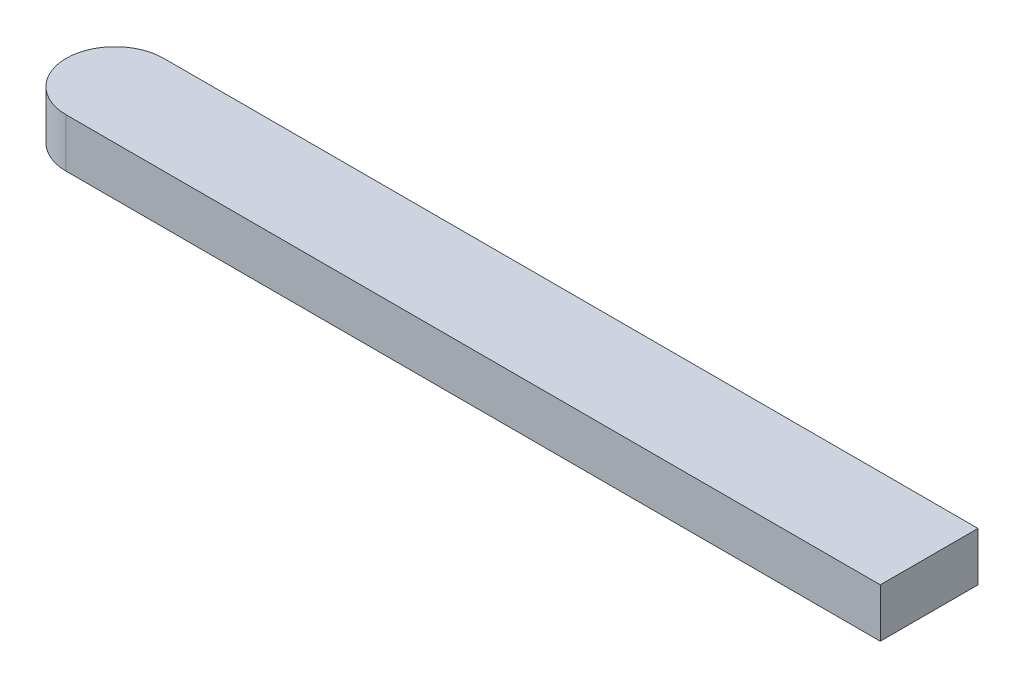
ISO-10303-21;
HEADER;
FILE_DESCRIPTION(('STEP AP214'),'2;1');
FILE_NAME('part.step','',(''),(''),'','','');
FILE_SCHEMA(('AUTOMOTIVE_DESIGN { 1 0 10303 214 1 1 1 1 }'));
ENDSEC;
DATA;
#1=APPLICATION_CONTEXT('core data for automotive mechanical design processes');
#2=APPLICATION_PROTOCOL_DEFINITION('international standard','automotive_design',2000,#1);
#3=PRODUCT_CONTEXT('',#1,'mechanical');
#4=PRODUCT('Part','Part','',(#3));
#5=PRODUCT_RELATED_PRODUCT_CATEGORY('part','',(#4));
#6=PRODUCT_DEFINITION_FORMATION('','',#4);
#7=PRODUCT_DEFINITION_CONTEXT('part definition',#1,'design');
#8=PRODUCT_DEFINITION('design','',#6,#7);
#9=PRODUCT_DEFINITION_SHAPE('','',#8);
#10=(LENGTH_UNIT() NAMED_UNIT(*) SI_UNIT(.MILLI.,.METRE.));
#11=(NAMED_UNIT(*) PLANE_ANGLE_UNIT() SI_UNIT($,.RADIAN.));
#12=(NAMED_UNIT(*) SI_UNIT($,.STERADIAN.) SOLID_ANGLE_UNIT());
#13=UNCERTAINTY_MEASURE_WITH_UNIT(LENGTH_MEASURE(1.E-05),#10,'distance_accuracy_value','');
#14=(GEOMETRIC_REPRESENTATION_CONTEXT(3) GLOBAL_UNCERTAINTY_ASSIGNED_CONTEXT((#13)) GLOBAL_UNIT_ASSIGNED_CONTEXT((#10,
#11,#12)) REPRESENTATION_CONTEXT('',''));
#15=CARTESIAN_POINT('',(0.,0.,0.));
#16=DIRECTION('',(0.,0.,1.));
#17=DIRECTION('',(1.,0.,0.));
#18=AXIS2_PLACEMENT_3D('',#15,#16,#17);
#19=CARTESIAN_POINT('',(0.,3.,0.));
#20=DIRECTION('',(0.,-1.,0.));
#21=DIRECTION('',(0.,0.,-1.));
#22=AXIS2_PLACEMENT_3D('',#19,#20,#21);
#23=CYLINDRICAL_SURFACE('',#22,3.);
#24=CARTESIAN_POINT('',(0.,0.,0.));
#25=DIRECTION('',(0.,1.,0.));
#26=DIRECTION('',(0.,0.,1.));
#27=AXIS2_PLACEMENT_3D('',#24,#25,#26);
#28=CIRCLE('',#27,3.);
#29=CARTESIAN_POINT('',(0.,0.,-3.));
#30=VERTEX_POINT('',#29);
#31=CARTESIAN_POINT('',(0.,0.,3.));
#32=VERTEX_POINT('',#31);
#33=EDGE_CURVE('E114',#30,#32,#28,.T.);
#34=ORIENTED_EDGE('',*,*,#33,.T.);
#35=DIRECTION('',(0.,-1.,0.));
#36=VECTOR('',#35,1.);
#37=CARTESIAN_POINT('',(0.,3.,3.));
#38=LINE('',#37,#36);
#39=CARTESIAN_POINT('',(0.,3.,3.));
#40=VERTEX_POINT('',#39);
#41=EDGE_CURVE('E66',#40,#32,#38,.T.);
#42=ORIENTED_EDGE('',*,*,#41,.F.);
#43=CARTESIAN_POINT('',(0.,3.,0.));
#44=DIRECTION('',(0.,1.,0.));
#45=DIRECTION('',(0.,0.,1.));
#46=AXIS2_PLACEMENT_3D('',#43,#44,#45);
#47=CIRCLE('',#46,3.);
#48=CARTESIAN_POINT('',(0.,3.,-3.));
#49=VERTEX_POINT('',#48);
#50=EDGE_CURVE('E125',#49,#40,#47,.T.);
#51=ORIENTED_EDGE('',*,*,#50,.F.);
#52=DIRECTION('',(0.,-1.,0.));
#53=VECTOR('',#52,1.);
#54=CARTESIAN_POINT('',(0.,3.,-3.));
#55=LINE('',#54,#53);
#56=EDGE_CURVE('E12',#49,#30,#55,.T.);
#57=ORIENTED_EDGE('',*,*,#56,.T.);
#58=EDGE_LOOP('',(#34,#42,#51,#57));
#59=FACE_BOUND('',#58,.T.);
#60=ADVANCED_FACE('F56',(#59),#23,.T.);
#61=CARTESIAN_POINT('',(0.,3.,0.));
#62=DIRECTION('',(0.,1.,0.));
#63=DIRECTION('',(0.,0.,1.));
#64=AXIS2_PLACEMENT_3D('',#61,#62,#63);
#65=PLANE('',#64);
#66=ORIENTED_EDGE('',*,*,#50,.T.);
#67=DIRECTION('',(1.,0.,0.));
#68=VECTOR('',#67,1.);
#69=CARTESIAN_POINT('',(0.,3.,3.));
#70=LINE('',#69,#68);
#71=CARTESIAN_POINT('',(50.,3.,3.));
#72=VERTEX_POINT('',#71);
#73=EDGE_CURVE('E120',#40,#72,#70,.T.);
#74=ORIENTED_EDGE('',*,*,#73,.T.);
#75=DIRECTION('',(0.,0.,-1.));
#76=VECTOR('',#75,1.);
#77=CARTESIAN_POINT('',(50.,3.,3.));
#78=LINE('',#77,#76);
#79=CARTESIAN_POINT('',(50.,3.,-3.));
#80=VERTEX_POINT('',#79);
#81=EDGE_CURVE('E113',#72,#80,#78,.T.);
#82=ORIENTED_EDGE('',*,*,#81,.T.);
#83=DIRECTION('',(1.,0.,0.));
#84=VECTOR('',#83,1.);
#85=CARTESIAN_POINT('',(0.,3.,-3.));
#86=LINE('',#85,#84);
#87=EDGE_CURVE('E107',#49,#80,#86,.T.);
#88=ORIENTED_EDGE('',*,*,#87,.F.);
#89=EDGE_LOOP('',(#66,#74,#82,#88));
#90=FACE_BOUND('',#89,.T.);
#91=ADVANCED_FACE('F130',(#90),#65,.T.);
#92=CARTESIAN_POINT('',(0.,0.,0.));
#93=DIRECTION('',(0.,1.,0.));
#94=DIRECTION('',(0.,0.,1.));
#95=AXIS2_PLACEMENT_3D('',#92,#93,#94);
#96=PLANE('',#95);
#97=ORIENTED_EDGE('',*,*,#33,.F.);
#98=DIRECTION('',(1.,0.,0.));
#99=VECTOR('',#98,1.);
#100=CARTESIAN_POINT('',(0.,0.,-3.));
#101=LINE('',#100,#99);
#102=CARTESIAN_POINT('',(50.,0.,-3.));
#103=VERTEX_POINT('',#102);
#104=EDGE_CURVE('E116',#30,#103,#101,.T.);
#105=ORIENTED_EDGE('',*,*,#104,.T.);
#106=DIRECTION('',(0.,0.,-1.));
#107=VECTOR('',#106,1.);
#108=CARTESIAN_POINT('',(50.,0.,3.));
#109=LINE('',#108,#107);
#110=CARTESIAN_POINT('',(50.,0.,3.));
#111=VERTEX_POINT('',#110);
#112=EDGE_CURVE('E108',#111,#103,#109,.T.);
#113=ORIENTED_EDGE('',*,*,#112,.F.);
#114=DIRECTION('',(1.,0.,0.));
#115=VECTOR('',#114,1.);
#116=CARTESIAN_POINT('',(0.,0.,3.));
#117=LINE('',#116,#115);
#118=EDGE_CURVE('E99',#32,#111,#117,.T.);
#119=ORIENTED_EDGE('',*,*,#118,.F.);
#120=EDGE_LOOP('',(#97,#105,#113,#119));
#121=FACE_BOUND('',#120,.T.);
#122=ADVANCED_FACE('F115',(#121),#96,.F.);
#123=CARTESIAN_POINT('',(0.,3.,3.));
#124=DIRECTION('',(0.,0.,-1.));
#125=DIRECTION('',(-1.,0.,0.));
#126=AXIS2_PLACEMENT_3D('',#123,#124,#125);
#127=PLANE('',#126);
#128=ORIENTED_EDGE('',*,*,#118,.T.);
#129=DIRECTION('',(0.,-1.,0.));
#130=VECTOR('',#129,1.);
#131=CARTESIAN_POINT('',(50.,3.,3.));
#132=LINE('',#131,#130);
#133=EDGE_CURVE('E102',#72,#111,#132,.T.);
#134=ORIENTED_EDGE('',*,*,#133,.F.);
#135=ORIENTED_EDGE('',*,*,#73,.F.);
#136=ORIENTED_EDGE('',*,*,#41,.T.);
#137=EDGE_LOOP('',(#128,#134,#135,#136));
#138=FACE_BOUND('',#137,.T.);
#139=ADVANCED_FACE('F101',(#138),#127,.F.);
#140=CARTESIAN_POINT('',(50.,3.,3.));
#141=DIRECTION('',(-1.,0.,0.));
#142=DIRECTION('',(0.,0.,1.));
#143=AXIS2_PLACEMENT_3D('',#140,#141,#142);
#144=PLANE('',#143);
#145=ORIENTED_EDGE('',*,*,#112,.T.);
#146=DIRECTION('',(0.,-1.,0.));
#147=VECTOR('',#146,1.);
#148=CARTESIAN_POINT('',(50.,3.,-3.));
#149=LINE('',#148,#147);
#150=EDGE_CURVE('E60',#80,#103,#149,.T.);
#151=ORIENTED_EDGE('',*,*,#150,.F.);
#152=ORIENTED_EDGE('',*,*,#81,.F.);
#153=ORIENTED_EDGE('',*,*,#133,.T.);
#154=EDGE_LOOP('',(#145,#151,#152,#153));
#155=FACE_BOUND('',#154,.T.);
#156=ADVANCED_FACE('F111',(#155),#144,.F.);
#157=CARTESIAN_POINT('',(0.,3.,-3.));
#158=DIRECTION('',(0.,0.,-1.));
#159=DIRECTION('',(-1.,0.,0.));
#160=AXIS2_PLACEMENT_3D('',#157,#158,#159);
#161=PLANE('',#160);
#162=ORIENTED_EDGE('',*,*,#104,.F.);
#163=ORIENTED_EDGE('',*,*,#56,.F.);
#164=ORIENTED_EDGE('',*,*,#87,.T.);
#165=ORIENTED_EDGE('',*,*,#150,.T.);
#166=EDGE_LOOP('',(#162,#163,#164,#165));
#167=FACE_BOUND('',#166,.T.);
#168=ADVANCED_FACE('F58',(#167),#161,.T.);
#169=CLOSED_SHELL('',(#60,#91,#122,#139,#156,#168));
#170=MANIFOLD_SOLID_BREP('B2',#169);
#171=ADVANCED_BREP_SHAPE_REPRESENTATION('',(#18,#170),#14);
#172=SHAPE_DEFINITION_REPRESENTATION(#9,#171);
ENDSEC;
END-ISO-10303-21;
